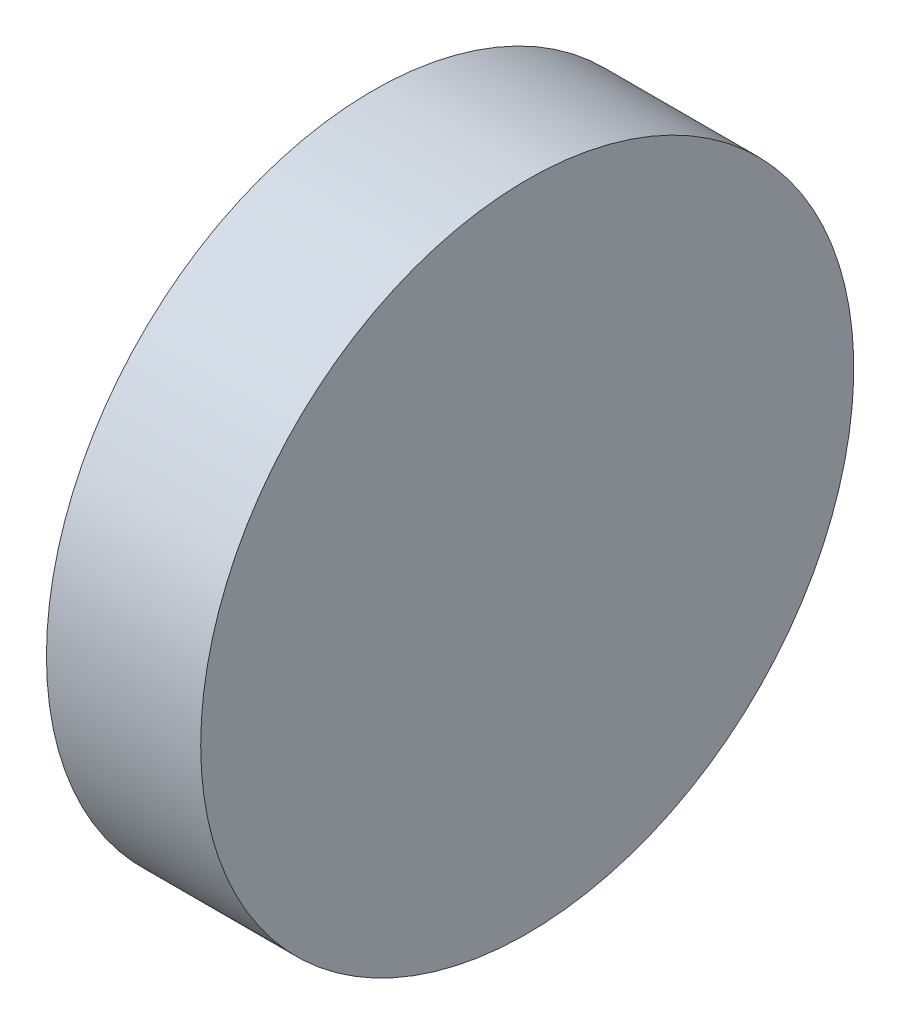
ISO-10303-21;
HEADER;
FILE_DESCRIPTION(('STEP AP214'),'2;1');
FILE_NAME('part.step','',(''),(''),'','','');
FILE_SCHEMA(('AUTOMOTIVE_DESIGN { 1 0 10303 214 1 1 1 1 }'));
ENDSEC;
DATA;
#1=APPLICATION_CONTEXT('core data for automotive mechanical design processes');
#2=APPLICATION_PROTOCOL_DEFINITION('international standard','automotive_design',2000,#1);
#3=PRODUCT_CONTEXT('',#1,'mechanical');
#4=PRODUCT('Part','Part','',(#3));
#5=PRODUCT_RELATED_PRODUCT_CATEGORY('part','',(#4));
#6=PRODUCT_DEFINITION_FORMATION('','',#4);
#7=PRODUCT_DEFINITION_CONTEXT('part definition',#1,'design');
#8=PRODUCT_DEFINITION('design','',#6,#7);
#9=PRODUCT_DEFINITION_SHAPE('','',#8);
#10=(LENGTH_UNIT() NAMED_UNIT(*) SI_UNIT(.MILLI.,.METRE.));
#11=(NAMED_UNIT(*) PLANE_ANGLE_UNIT() SI_UNIT($,.RADIAN.));
#12=(NAMED_UNIT(*) SI_UNIT($,.STERADIAN.) SOLID_ANGLE_UNIT());
#13=UNCERTAINTY_MEASURE_WITH_UNIT(LENGTH_MEASURE(1.E-05),#10,'distance_accuracy_value','');
#14=(GEOMETRIC_REPRESENTATION_CONTEXT(3) GLOBAL_UNCERTAINTY_ASSIGNED_CONTEXT((#13)) GLOBAL_UNIT_ASSIGNED_CONTEXT((#10,
#11,#12)) REPRESENTATION_CONTEXT('',''));
#15=CARTESIAN_POINT('',(0.,0.,0.));
#16=DIRECTION('',(0.,0.,1.));
#17=DIRECTION('',(1.,0.,0.));
#18=AXIS2_PLACEMENT_3D('',#15,#16,#17);
#19=CARTESIAN_POINT('',(274.816825870934,77.2931793490154,0.));
#20=DIRECTION('',(-1.,0.,0.));
#21=DIRECTION('',(0.,0.,1.));
#22=AXIS2_PLACEMENT_3D('',#19,#20,#21);
#23=PLANE('',#22);
#24=CARTESIAN_POINT('',(274.816825870934,77.2931793490154,0.));
#25=DIRECTION('',(-1.,0.,0.));
#26=DIRECTION('',(0.,0.,1.));
#27=AXIS2_PLACEMENT_3D('',#24,#25,#26);
#28=CIRCLE('',#27,12.7);
#29=CARTESIAN_POINT('',(274.816825870934,77.2931793490154,12.7));
#30=VERTEX_POINT('',#29);
#31=EDGE_CURVE('E10',#30,#30,#28,.T.);
#32=ORIENTED_EDGE('',*,*,#31,.F.);
#33=EDGE_LOOP('',(#32));
#34=FACE_BOUND('',#33,.T.);
#35=ADVANCED_FACE('F33',(#34),#23,.F.);
#36=CARTESIAN_POINT('',(263.093274970486,77.2931793490154,0.));
#37=DIRECTION('',(-1.,0.,0.));
#38=DIRECTION('',(0.,0.,1.));
#39=AXIS2_PLACEMENT_3D('',#36,#37,#38);
#40=CYLINDRICAL_SURFACE('',#39,12.7);
#41=CARTESIAN_POINT('',(268.816825870934,77.2931793490154,0.));
#42=DIRECTION('',(-1.,0.,0.));
#43=DIRECTION('',(0.,0.,1.));
#44=AXIS2_PLACEMENT_3D('',#41,#42,#43);
#45=CIRCLE('',#44,12.7);
#46=CARTESIAN_POINT('',(268.816825870934,77.2931793490154,12.7));
#47=VERTEX_POINT('',#46);
#48=EDGE_CURVE('E39',#47,#47,#45,.T.);
#49=ORIENTED_EDGE('',*,*,#48,.F.);
#50=EDGE_LOOP('',(#49));
#51=FACE_BOUND('',#50,.T.);
#52=ORIENTED_EDGE('',*,*,#31,.T.);
#53=EDGE_LOOP('',(#52));
#54=FACE_BOUND('',#53,.T.);
#55=ADVANCED_FACE('F47',(#51,#54),#40,.T.);
#56=CARTESIAN_POINT('',(268.816825870934,77.2931793490154,0.));
#57=DIRECTION('',(1.,0.,0.));
#58=DIRECTION('',(0.,0.,-1.));
#59=AXIS2_PLACEMENT_3D('',#56,#57,#58);
#60=PLANE('',#59);
#61=ORIENTED_EDGE('',*,*,#48,.T.);
#62=EDGE_LOOP('',(#61));
#63=FACE_BOUND('',#62,.T.);
#64=ADVANCED_FACE('F45',(#63),#60,.F.);
#65=CLOSED_SHELL('',(#35,#55,#64));
#66=MANIFOLD_SOLID_BREP('B2',#65);
#67=ADVANCED_BREP_SHAPE_REPRESENTATION('',(#18,#66),#14);
#68=SHAPE_DEFINITION_REPRESENTATION(#9,#67);
ENDSEC;
END-ISO-10303-21;
